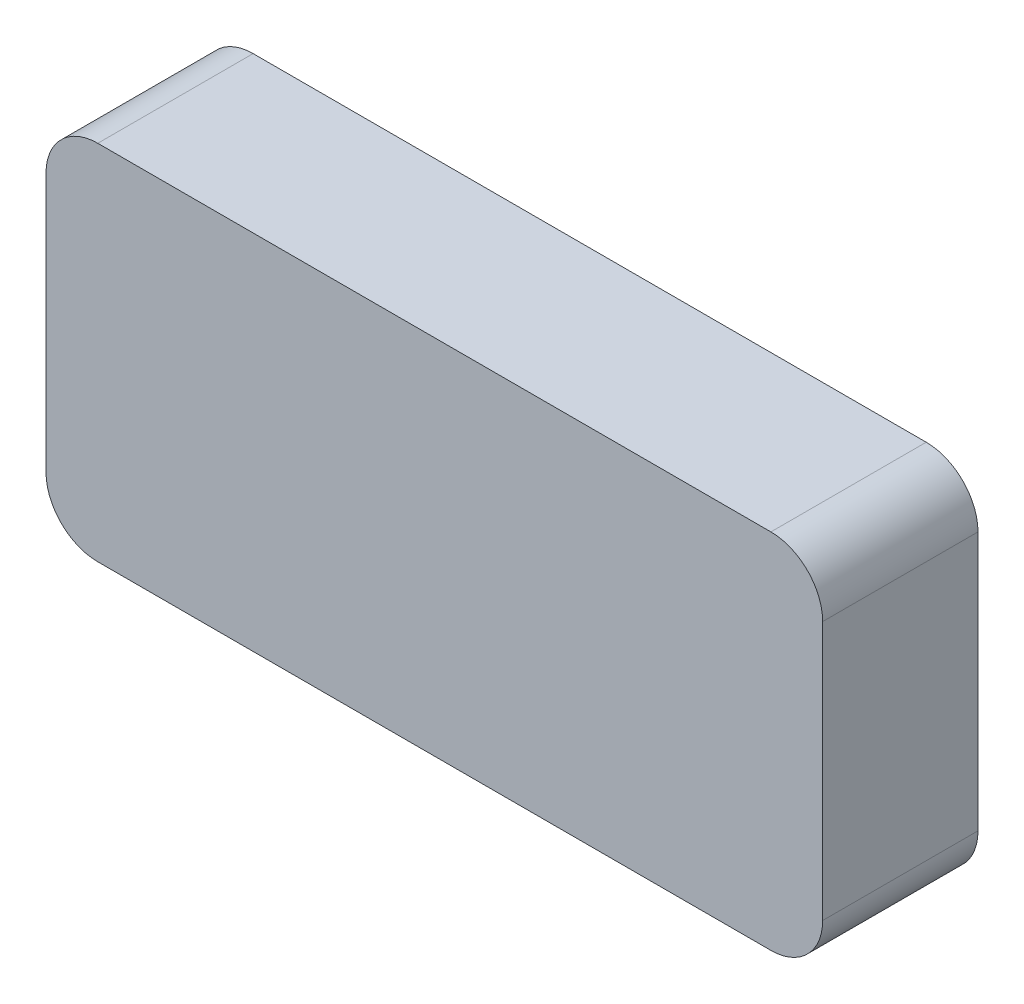
ISO-10303-21;
HEADER;
FILE_DESCRIPTION(('STEP AP214'),'2;1');
FILE_NAME('part.step','',(''),(''),'','','');
FILE_SCHEMA(('AUTOMOTIVE_DESIGN { 1 0 10303 214 1 1 1 1 }'));
ENDSEC;
DATA;
#1=APPLICATION_CONTEXT('core data for automotive mechanical design processes');
#2=APPLICATION_PROTOCOL_DEFINITION('international standard','automotive_design',2000,#1);
#3=PRODUCT_CONTEXT('',#1,'mechanical');
#4=PRODUCT('Part','Part','',(#3));
#5=PRODUCT_RELATED_PRODUCT_CATEGORY('part','',(#4));
#6=PRODUCT_DEFINITION_FORMATION('','',#4);
#7=PRODUCT_DEFINITION_CONTEXT('part definition',#1,'design');
#8=PRODUCT_DEFINITION('design','',#6,#7);
#9=PRODUCT_DEFINITION_SHAPE('','',#8);
#10=(LENGTH_UNIT() NAMED_UNIT(*) SI_UNIT(.MILLI.,.METRE.));
#11=(NAMED_UNIT(*) PLANE_ANGLE_UNIT() SI_UNIT($,.RADIAN.));
#12=(NAMED_UNIT(*) SI_UNIT($,.STERADIAN.) SOLID_ANGLE_UNIT());
#13=UNCERTAINTY_MEASURE_WITH_UNIT(LENGTH_MEASURE(1.E-05),#10,'distance_accuracy_value','');
#14=(GEOMETRIC_REPRESENTATION_CONTEXT(3) GLOBAL_UNCERTAINTY_ASSIGNED_CONTEXT((#13)) GLOBAL_UNIT_ASSIGNED_CONTEXT((#10,
#11,#12)) REPRESENTATION_CONTEXT('',''));
#15=CARTESIAN_POINT('',(0.,0.,0.));
#16=DIRECTION('',(0.,0.,1.));
#17=DIRECTION('',(1.,0.,0.));
#18=AXIS2_PLACEMENT_3D('',#15,#16,#17);
#19=CARTESIAN_POINT('',(0.,0.,30.));
#20=DIRECTION('',(1.,0.,0.));
#21=DIRECTION('',(0.,1.,0.));
#22=AXIS2_PLACEMENT_3D('',#19,#20,#21);
#23=PLANE('',#22);
#24=DIRECTION('',(0.,-1.,0.));
#25=VECTOR('',#24,1.);
#26=CARTESIAN_POINT('',(0.,0.,0.));
#27=LINE('',#26,#25);
#28=CARTESIAN_POINT('',(0.,-10.,0.));
#29=VERTEX_POINT('',#28);
#30=CARTESIAN_POINT('',(0.,-60.,0.));
#31=VERTEX_POINT('',#30);
#32=EDGE_CURVE('E128',#29,#31,#27,.T.);
#33=ORIENTED_EDGE('',*,*,#32,.T.);
#34=DIRECTION('',(0.,0.,-1.));
#35=VECTOR('',#34,1.);
#36=CARTESIAN_POINT('',(0.,-60.,30.));
#37=LINE('',#36,#35);
#38=CARTESIAN_POINT('',(0.,-60.,30.));
#39=VERTEX_POINT('',#38);
#40=EDGE_CURVE('E151',#31,#39,#37,.F.);
#41=ORIENTED_EDGE('',*,*,#40,.T.);
#42=DIRECTION('',(0.,-1.,0.));
#43=VECTOR('',#42,1.);
#44=CARTESIAN_POINT('',(0.,0.,30.));
#45=LINE('',#44,#43);
#46=CARTESIAN_POINT('',(0.,-10.,30.));
#47=VERTEX_POINT('',#46);
#48=EDGE_CURVE('E126',#47,#39,#45,.T.);
#49=ORIENTED_EDGE('',*,*,#48,.F.);
#50=DIRECTION('',(0.,0.,-1.));
#51=VECTOR('',#50,1.);
#52=CARTESIAN_POINT('',(0.,-10.,30.));
#53=LINE('',#52,#51);
#54=EDGE_CURVE('E148',#47,#29,#53,.T.);
#55=ORIENTED_EDGE('',*,*,#54,.T.);
#56=EDGE_LOOP('',(#33,#41,#49,#55));
#57=FACE_BOUND('',#56,.T.);
#58=ADVANCED_FACE('F33',(#57),#23,.F.);
#59=CARTESIAN_POINT('',(0.,-70.,30.));
#60=DIRECTION('',(0.,1.,0.));
#61=DIRECTION('',(0.,0.,1.));
#62=AXIS2_PLACEMENT_3D('',#59,#60,#61);
#63=PLANE('',#62);
#64=DIRECTION('',(1.,0.,0.));
#65=VECTOR('',#64,1.);
#66=CARTESIAN_POINT('',(0.,-70.,0.));
#67=LINE('',#66,#65);
#68=CARTESIAN_POINT('',(10.,-70.,0.));
#69=VERTEX_POINT('',#68);
#70=CARTESIAN_POINT('',(140.,-70.,0.));
#71=VERTEX_POINT('',#70);
#72=EDGE_CURVE('E124',#69,#71,#67,.T.);
#73=ORIENTED_EDGE('',*,*,#72,.T.);
#74=DIRECTION('',(0.,0.,-1.));
#75=VECTOR('',#74,1.);
#76=CARTESIAN_POINT('',(140.,-70.,30.));
#77=LINE('',#76,#75);
#78=CARTESIAN_POINT('',(140.,-70.,30.));
#79=VERTEX_POINT('',#78);
#80=EDGE_CURVE('E103',#71,#79,#77,.F.);
#81=ORIENTED_EDGE('',*,*,#80,.T.);
#82=DIRECTION('',(1.,0.,0.));
#83=VECTOR('',#82,1.);
#84=CARTESIAN_POINT('',(0.,-70.,30.));
#85=LINE('',#84,#83);
#86=CARTESIAN_POINT('',(10.,-70.,30.));
#87=VERTEX_POINT('',#86);
#88=EDGE_CURVE('E167',#87,#79,#85,.T.);
#89=ORIENTED_EDGE('',*,*,#88,.F.);
#90=DIRECTION('',(0.,0.,-1.));
#91=VECTOR('',#90,1.);
#92=CARTESIAN_POINT('',(10.,-70.,30.));
#93=LINE('',#92,#91);
#94=EDGE_CURVE('E108',#87,#69,#93,.T.);
#95=ORIENTED_EDGE('',*,*,#94,.T.);
#96=EDGE_LOOP('',(#73,#81,#89,#95));
#97=FACE_BOUND('',#96,.T.);
#98=ADVANCED_FACE('F184',(#97),#63,.F.);
#99=CARTESIAN_POINT('',(150.,0.,30.));
#100=DIRECTION('',(-1.,0.,0.));
#101=DIRECTION('',(0.,0.,1.));
#102=AXIS2_PLACEMENT_3D('',#99,#100,#101);
#103=PLANE('',#102);
#104=DIRECTION('',(0.,1.,0.));
#105=VECTOR('',#104,1.);
#106=CARTESIAN_POINT('',(150.,0.,30.));
#107=LINE('',#106,#105);
#108=CARTESIAN_POINT('',(150.,-60.,30.));
#109=VERTEX_POINT('',#108);
#110=CARTESIAN_POINT('',(150.,-10.,30.));
#111=VERTEX_POINT('',#110);
#112=EDGE_CURVE('E117',#109,#111,#107,.T.);
#113=ORIENTED_EDGE('',*,*,#112,.F.);
#114=DIRECTION('',(0.,0.,-1.));
#115=VECTOR('',#114,1.);
#116=CARTESIAN_POINT('',(150.,-60.,30.));
#117=LINE('',#116,#115);
#118=CARTESIAN_POINT('',(150.,-60.,0.));
#119=VERTEX_POINT('',#118);
#120=EDGE_CURVE('E102',#109,#119,#117,.T.);
#121=ORIENTED_EDGE('',*,*,#120,.T.);
#122=DIRECTION('',(0.,1.,0.));
#123=VECTOR('',#122,1.);
#124=CARTESIAN_POINT('',(150.,0.,0.));
#125=LINE('',#124,#123);
#126=CARTESIAN_POINT('',(150.,-10.,0.));
#127=VERTEX_POINT('',#126);
#128=EDGE_CURVE('E115',#119,#127,#125,.T.);
#129=ORIENTED_EDGE('',*,*,#128,.T.);
#130=DIRECTION('',(0.,0.,-1.));
#131=VECTOR('',#130,1.);
#132=CARTESIAN_POINT('',(150.,-10.,30.));
#133=LINE('',#132,#131);
#134=EDGE_CURVE('E119',#127,#111,#133,.F.);
#135=ORIENTED_EDGE('',*,*,#134,.T.);
#136=EDGE_LOOP('',(#113,#121,#129,#135));
#137=FACE_BOUND('',#136,.T.);
#138=ADVANCED_FACE('F114',(#137),#103,.F.);
#139=CARTESIAN_POINT('',(0.,0.,30.));
#140=DIRECTION('',(0.,-1.,0.));
#141=DIRECTION('',(0.,0.,-1.));
#142=AXIS2_PLACEMENT_3D('',#139,#140,#141);
#143=PLANE('',#142);
#144=DIRECTION('',(-1.,0.,0.));
#145=VECTOR('',#144,1.);
#146=CARTESIAN_POINT('',(0.,0.,0.));
#147=LINE('',#146,#145);
#148=CARTESIAN_POINT('',(140.,0.,0.));
#149=VERTEX_POINT('',#148);
#150=CARTESIAN_POINT('',(10.,0.,0.));
#151=VERTEX_POINT('',#150);
#152=EDGE_CURVE('E123',#149,#151,#147,.T.);
#153=ORIENTED_EDGE('',*,*,#152,.T.);
#154=DIRECTION('',(0.,0.,-1.));
#155=VECTOR('',#154,1.);
#156=CARTESIAN_POINT('',(10.,0.,30.));
#157=LINE('',#156,#155);
#158=CARTESIAN_POINT('',(10.,0.,30.));
#159=VERTEX_POINT('',#158);
#160=EDGE_CURVE('E11',#151,#159,#157,.F.);
#161=ORIENTED_EDGE('',*,*,#160,.T.);
#162=DIRECTION('',(-1.,0.,0.));
#163=VECTOR('',#162,1.);
#164=CARTESIAN_POINT('',(0.,0.,30.));
#165=LINE('',#164,#163);
#166=CARTESIAN_POINT('',(140.,0.,30.));
#167=VERTEX_POINT('',#166);
#168=EDGE_CURVE('E132',#167,#159,#165,.T.);
#169=ORIENTED_EDGE('',*,*,#168,.F.);
#170=DIRECTION('',(0.,0.,-1.));
#171=VECTOR('',#170,1.);
#172=CARTESIAN_POINT('',(140.,0.,30.));
#173=LINE('',#172,#171);
#174=EDGE_CURVE('E41',#167,#149,#173,.T.);
#175=ORIENTED_EDGE('',*,*,#174,.T.);
#176=EDGE_LOOP('',(#153,#161,#169,#175));
#177=FACE_BOUND('',#176,.T.);
#178=ADVANCED_FACE('F154',(#177),#143,.F.);
#179=CARTESIAN_POINT('',(0.,0.,30.));
#180=DIRECTION('',(0.,0.,1.));
#181=DIRECTION('',(1.,0.,0.));
#182=AXIS2_PLACEMENT_3D('',#179,#180,#181);
#183=PLANE('',#182);
#184=ORIENTED_EDGE('',*,*,#88,.T.);
#185=CARTESIAN_POINT('',(140.,-60.,30.));
#186=DIRECTION('',(0.,0.,1.));
#187=DIRECTION('',(1.,0.,0.));
#188=AXIS2_PLACEMENT_3D('',#185,#186,#187);
#189=CIRCLE('',#188,10.);
#190=EDGE_CURVE('E146',#79,#109,#189,.T.);
#191=ORIENTED_EDGE('',*,*,#190,.T.);
#192=ORIENTED_EDGE('',*,*,#112,.T.);
#193=CARTESIAN_POINT('',(140.,-10.,30.));
#194=DIRECTION('',(0.,0.,1.));
#195=DIRECTION('',(1.,0.,0.));
#196=AXIS2_PLACEMENT_3D('',#193,#194,#195);
#197=CIRCLE('',#196,10.);
#198=EDGE_CURVE('E53',#111,#167,#197,.T.);
#199=ORIENTED_EDGE('',*,*,#198,.T.);
#200=ORIENTED_EDGE('',*,*,#168,.T.);
#201=CARTESIAN_POINT('',(10.,-10.,30.));
#202=DIRECTION('',(0.,0.,1.));
#203=DIRECTION('',(1.,0.,0.));
#204=AXIS2_PLACEMENT_3D('',#201,#202,#203);
#205=CIRCLE('',#204,10.);
#206=EDGE_CURVE('E142',#159,#47,#205,.T.);
#207=ORIENTED_EDGE('',*,*,#206,.T.);
#208=ORIENTED_EDGE('',*,*,#48,.T.);
#209=CARTESIAN_POINT('',(10.,-60.,30.));
#210=DIRECTION('',(0.,0.,1.));
#211=DIRECTION('',(1.,0.,0.));
#212=AXIS2_PLACEMENT_3D('',#209,#210,#211);
#213=CIRCLE('',#212,10.);
#214=EDGE_CURVE('E144',#39,#87,#213,.T.);
#215=ORIENTED_EDGE('',*,*,#214,.T.);
#216=EDGE_LOOP('',(#184,#191,#192,#199,#200,#207,#208,#215));
#217=FACE_BOUND('',#216,.T.);
#218=ADVANCED_FACE('F173',(#217),#183,.T.);
#219=CARTESIAN_POINT('',(0.,0.,0.));
#220=DIRECTION('',(0.,0.,1.));
#221=DIRECTION('',(1.,0.,0.));
#222=AXIS2_PLACEMENT_3D('',#219,#220,#221);
#223=PLANE('',#222);
#224=ORIENTED_EDGE('',*,*,#128,.F.);
#225=CARTESIAN_POINT('',(140.,-60.,0.));
#226=DIRECTION('',(0.,0.,1.));
#227=DIRECTION('',(1.,0.,0.));
#228=AXIS2_PLACEMENT_3D('',#225,#226,#227);
#229=CIRCLE('',#228,10.);
#230=EDGE_CURVE('E98',#119,#71,#229,.F.);
#231=ORIENTED_EDGE('',*,*,#230,.T.);
#232=ORIENTED_EDGE('',*,*,#72,.F.);
#233=CARTESIAN_POINT('',(10.,-60.,0.));
#234=DIRECTION('',(0.,0.,1.));
#235=DIRECTION('',(1.,0.,0.));
#236=AXIS2_PLACEMENT_3D('',#233,#234,#235);
#237=CIRCLE('',#236,10.);
#238=EDGE_CURVE('E109',#69,#31,#237,.F.);
#239=ORIENTED_EDGE('',*,*,#238,.T.);
#240=ORIENTED_EDGE('',*,*,#32,.F.);
#241=CARTESIAN_POINT('',(10.,-10.,0.));
#242=DIRECTION('',(0.,0.,1.));
#243=DIRECTION('',(1.,0.,0.));
#244=AXIS2_PLACEMENT_3D('',#241,#242,#243);
#245=CIRCLE('',#244,10.);
#246=EDGE_CURVE('E135',#29,#151,#245,.F.);
#247=ORIENTED_EDGE('',*,*,#246,.T.);
#248=ORIENTED_EDGE('',*,*,#152,.F.);
#249=CARTESIAN_POINT('',(140.,-10.,0.));
#250=DIRECTION('',(0.,0.,1.));
#251=DIRECTION('',(1.,0.,0.));
#252=AXIS2_PLACEMENT_3D('',#249,#250,#251);
#253=CIRCLE('',#252,10.);
#254=EDGE_CURVE('E118',#149,#127,#253,.F.);
#255=ORIENTED_EDGE('',*,*,#254,.T.);
#256=EDGE_LOOP('',(#224,#231,#232,#239,#240,#247,#248,#255));
#257=FACE_BOUND('',#256,.T.);
#258=ADVANCED_FACE('F121',(#257),#223,.F.);
#259=CARTESIAN_POINT('',(140.,-60.,30.));
#260=DIRECTION('',(0.,0.,-1.));
#261=DIRECTION('',(-1.,0.,0.));
#262=AXIS2_PLACEMENT_3D('',#259,#260,#261);
#263=CYLINDRICAL_SURFACE('',#262,10.);
#264=ORIENTED_EDGE('',*,*,#190,.F.);
#265=ORIENTED_EDGE('',*,*,#80,.F.);
#266=ORIENTED_EDGE('',*,*,#230,.F.);
#267=ORIENTED_EDGE('',*,*,#120,.F.);
#268=EDGE_LOOP('',(#264,#265,#266,#267));
#269=FACE_BOUND('',#268,.T.);
#270=ADVANCED_FACE('F101',(#269),#263,.T.);
#271=CARTESIAN_POINT('',(10.,-60.,30.));
#272=DIRECTION('',(0.,0.,-1.));
#273=DIRECTION('',(-1.,0.,0.));
#274=AXIS2_PLACEMENT_3D('',#271,#272,#273);
#275=CYLINDRICAL_SURFACE('',#274,10.);
#276=ORIENTED_EDGE('',*,*,#214,.F.);
#277=ORIENTED_EDGE('',*,*,#40,.F.);
#278=ORIENTED_EDGE('',*,*,#238,.F.);
#279=ORIENTED_EDGE('',*,*,#94,.F.);
#280=EDGE_LOOP('',(#276,#277,#278,#279));
#281=FACE_BOUND('',#280,.T.);
#282=ADVANCED_FACE('F195',(#281),#275,.T.);
#283=CARTESIAN_POINT('',(10.,-10.,30.));
#284=DIRECTION('',(0.,0.,-1.));
#285=DIRECTION('',(-1.,0.,0.));
#286=AXIS2_PLACEMENT_3D('',#283,#284,#285);
#287=CYLINDRICAL_SURFACE('',#286,10.);
#288=ORIENTED_EDGE('',*,*,#206,.F.);
#289=ORIENTED_EDGE('',*,*,#160,.F.);
#290=ORIENTED_EDGE('',*,*,#246,.F.);
#291=ORIENTED_EDGE('',*,*,#54,.F.);
#292=EDGE_LOOP('',(#288,#289,#290,#291));
#293=FACE_BOUND('',#292,.T.);
#294=ADVANCED_FACE('F161',(#293),#287,.T.);
#295=CARTESIAN_POINT('',(140.,-10.,30.));
#296=DIRECTION('',(0.,0.,-1.));
#297=DIRECTION('',(-1.,0.,0.));
#298=AXIS2_PLACEMENT_3D('',#295,#296,#297);
#299=CYLINDRICAL_SURFACE('',#298,10.);
#300=ORIENTED_EDGE('',*,*,#198,.F.);
#301=ORIENTED_EDGE('',*,*,#134,.F.);
#302=ORIENTED_EDGE('',*,*,#254,.F.);
#303=ORIENTED_EDGE('',*,*,#174,.F.);
#304=EDGE_LOOP('',(#300,#301,#302,#303));
#305=FACE_BOUND('',#304,.T.);
#306=ADVANCED_FACE('F35',(#305),#299,.T.);
#307=CLOSED_SHELL('',(#58,#98,#138,#178,#218,#258,#270,#282,#294,#306));
#308=MANIFOLD_SOLID_BREP('B2',#307);
#309=ADVANCED_BREP_SHAPE_REPRESENTATION('',(#18,#308),#14);
#310=SHAPE_DEFINITION_REPRESENTATION(#9,#309);
ENDSEC;
END-ISO-10303-21;
